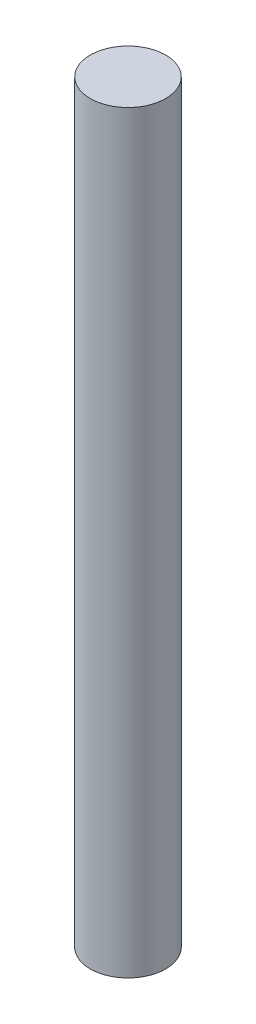
ISO-10303-21;
HEADER;
FILE_DESCRIPTION(('STEP AP214'),'2;1');
FILE_NAME('part.step','',(''),(''),'','','');
FILE_SCHEMA(('AUTOMOTIVE_DESIGN { 1 0 10303 214 1 1 1 1 }'));
ENDSEC;
DATA;
#1=APPLICATION_CONTEXT('core data for automotive mechanical design processes');
#2=APPLICATION_PROTOCOL_DEFINITION('international standard','automotive_design',2000,#1);
#3=PRODUCT_CONTEXT('',#1,'mechanical');
#4=PRODUCT('Part','Part','',(#3));
#5=PRODUCT_RELATED_PRODUCT_CATEGORY('part','',(#4));
#6=PRODUCT_DEFINITION_FORMATION('','',#4);
#7=PRODUCT_DEFINITION_CONTEXT('part definition',#1,'design');
#8=PRODUCT_DEFINITION('design','',#6,#7);
#9=PRODUCT_DEFINITION_SHAPE('','',#8);
#10=(LENGTH_UNIT() NAMED_UNIT(*) SI_UNIT(.MILLI.,.METRE.));
#11=(NAMED_UNIT(*) PLANE_ANGLE_UNIT() SI_UNIT($,.RADIAN.));
#12=(NAMED_UNIT(*) SI_UNIT($,.STERADIAN.) SOLID_ANGLE_UNIT());
#13=UNCERTAINTY_MEASURE_WITH_UNIT(LENGTH_MEASURE(1.E-05),#10,'distance_accuracy_value','');
#14=(GEOMETRIC_REPRESENTATION_CONTEXT(3) GLOBAL_UNCERTAINTY_ASSIGNED_CONTEXT((#13)) GLOBAL_UNIT_ASSIGNED_CONTEXT((#10,
#11,#12)) REPRESENTATION_CONTEXT('',''));
#15=CARTESIAN_POINT('',(0.,0.,0.));
#16=DIRECTION('',(0.,0.,1.));
#17=DIRECTION('',(1.,0.,0.));
#18=AXIS2_PLACEMENT_3D('',#15,#16,#17);
#19=CARTESIAN_POINT('',(0.,50.,0.));
#20=DIRECTION('',(0.,-1.,0.));
#21=DIRECTION('',(0.,0.,-1.));
#22=AXIS2_PLACEMENT_3D('',#19,#20,#21);
#23=CYLINDRICAL_SURFACE('',#22,2.5);
#24=CARTESIAN_POINT('',(0.,50.,0.));
#25=DIRECTION('',(0.,1.,0.));
#26=DIRECTION('',(0.,0.,1.));
#27=AXIS2_PLACEMENT_3D('',#24,#25,#26);
#28=CIRCLE('',#27,2.5);
#29=CARTESIAN_POINT('',(0.,50.,2.5));
#30=VERTEX_POINT('',#29);
#31=EDGE_CURVE('E10',#30,#30,#28,.T.);
#32=ORIENTED_EDGE('',*,*,#31,.F.);
#33=EDGE_LOOP('',(#32));
#34=FACE_BOUND('',#33,.T.);
#35=CARTESIAN_POINT('',(0.,0.,0.));
#36=DIRECTION('',(0.,1.,0.));
#37=DIRECTION('',(0.,0.,1.));
#38=AXIS2_PLACEMENT_3D('',#35,#36,#37);
#39=CIRCLE('',#38,2.5);
#40=CARTESIAN_POINT('',(0.,0.,2.5));
#41=VERTEX_POINT('',#40);
#42=EDGE_CURVE('E37',#41,#41,#39,.T.);
#43=ORIENTED_EDGE('',*,*,#42,.T.);
#44=EDGE_LOOP('',(#43));
#45=FACE_BOUND('',#44,.T.);
#46=ADVANCED_FACE('F34',(#34,#45),#23,.T.);
#47=CARTESIAN_POINT('',(0.,50.,0.));
#48=DIRECTION('',(0.,1.,0.));
#49=DIRECTION('',(0.,0.,1.));
#50=AXIS2_PLACEMENT_3D('',#47,#48,#49);
#51=PLANE('',#50);
#52=ORIENTED_EDGE('',*,*,#31,.T.);
#53=EDGE_LOOP('',(#52));
#54=FACE_BOUND('',#53,.T.);
#55=ADVANCED_FACE('F49',(#54),#51,.T.);
#56=CARTESIAN_POINT('',(0.,0.,0.));
#57=DIRECTION('',(0.,1.,0.));
#58=DIRECTION('',(0.,0.,1.));
#59=AXIS2_PLACEMENT_3D('',#56,#57,#58);
#60=PLANE('',#59);
#61=ORIENTED_EDGE('',*,*,#42,.F.);
#62=EDGE_LOOP('',(#61));
#63=FACE_BOUND('',#62,.T.);
#64=ADVANCED_FACE('F47',(#63),#60,.F.);
#65=CLOSED_SHELL('',(#46,#55,#64));
#66=MANIFOLD_SOLID_BREP('B2',#65);
#67=ADVANCED_BREP_SHAPE_REPRESENTATION('',(#18,#66),#14);
#68=SHAPE_DEFINITION_REPRESENTATION(#9,#67);
ENDSEC;
END-ISO-10303-21;
